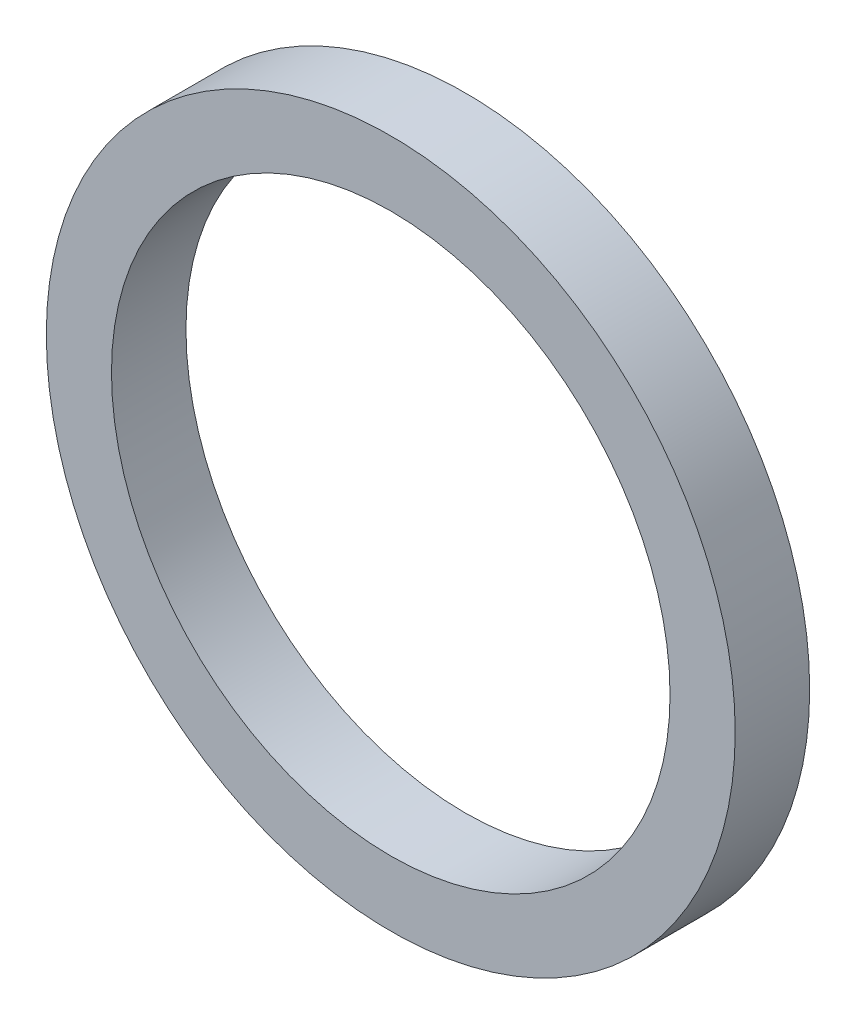
ISO-10303-21;
HEADER;
FILE_DESCRIPTION(('STEP AP214'),'2;1');
FILE_NAME('part.step','',(''),(''),'','','');
FILE_SCHEMA(('AUTOMOTIVE_DESIGN { 1 0 10303 214 1 1 1 1 }'));
ENDSEC;
DATA;
#1=APPLICATION_CONTEXT('core data for automotive mechanical design processes');
#2=APPLICATION_PROTOCOL_DEFINITION('international standard','automotive_design',2000,#1);
#3=PRODUCT_CONTEXT('',#1,'mechanical');
#4=PRODUCT('Part','Part','',(#3));
#5=PRODUCT_RELATED_PRODUCT_CATEGORY('part','',(#4));
#6=PRODUCT_DEFINITION_FORMATION('','',#4);
#7=PRODUCT_DEFINITION_CONTEXT('part definition',#1,'design');
#8=PRODUCT_DEFINITION('design','',#6,#7);
#9=PRODUCT_DEFINITION_SHAPE('','',#8);
#10=(LENGTH_UNIT() NAMED_UNIT(*) SI_UNIT(.MILLI.,.METRE.));
#11=(NAMED_UNIT(*) PLANE_ANGLE_UNIT() SI_UNIT($,.RADIAN.));
#12=(NAMED_UNIT(*) SI_UNIT($,.STERADIAN.) SOLID_ANGLE_UNIT());
#13=UNCERTAINTY_MEASURE_WITH_UNIT(LENGTH_MEASURE(1.E-05),#10,'distance_accuracy_value','');
#14=(GEOMETRIC_REPRESENTATION_CONTEXT(3) GLOBAL_UNCERTAINTY_ASSIGNED_CONTEXT((#13)) GLOBAL_UNIT_ASSIGNED_CONTEXT((#10,
#11,#12)) REPRESENTATION_CONTEXT('',''));
#15=CARTESIAN_POINT('',(0.,0.,0.));
#16=DIRECTION('',(0.,0.,1.));
#17=DIRECTION('',(1.,0.,0.));
#18=AXIS2_PLACEMENT_3D('',#15,#16,#17);
#19=CARTESIAN_POINT('',(0.,0.,4.));
#20=DIRECTION('',(0.,0.,1.));
#21=DIRECTION('',(1.,0.,0.));
#22=AXIS2_PLACEMENT_3D('',#19,#20,#21);
#23=PLANE('',#22);
#24=CARTESIAN_POINT('',(0.,0.,4.));
#25=DIRECTION('',(0.,0.,1.));
#26=DIRECTION('',(1.,0.,0.));
#27=AXIS2_PLACEMENT_3D('',#24,#25,#26);
#28=CIRCLE('',#27,18.5);
#29=CARTESIAN_POINT('',(18.5,0.,4.));
#30=VERTEX_POINT('',#29);
#31=EDGE_CURVE('E10',#30,#30,#28,.T.);
#32=ORIENTED_EDGE('',*,*,#31,.T.);
#33=EDGE_LOOP('',(#32));
#34=FACE_BOUND('',#33,.T.);
#35=CARTESIAN_POINT('',(0.,0.,4.));
#36=DIRECTION('',(0.,0.,1.));
#37=DIRECTION('',(1.,0.,0.));
#38=AXIS2_PLACEMENT_3D('',#35,#36,#37);
#39=CIRCLE('',#38,15.);
#40=CARTESIAN_POINT('',(15.,0.,4.));
#41=VERTEX_POINT('',#40);
#42=EDGE_CURVE('E48',#41,#41,#39,.T.);
#43=ORIENTED_EDGE('',*,*,#42,.F.);
#44=EDGE_LOOP('',(#43));
#45=FACE_BOUND('',#44,.T.);
#46=ADVANCED_FACE('F37',(#34,#45),#23,.T.);
#47=CARTESIAN_POINT('',(0.,0.,0.));
#48=DIRECTION('',(0.,0.,1.));
#49=DIRECTION('',(1.,0.,0.));
#50=AXIS2_PLACEMENT_3D('',#47,#48,#49);
#51=PLANE('',#50);
#52=CARTESIAN_POINT('',(0.,0.,0.));
#53=DIRECTION('',(0.,0.,1.));
#54=DIRECTION('',(1.,0.,0.));
#55=AXIS2_PLACEMENT_3D('',#52,#53,#54);
#56=CIRCLE('',#55,18.5);
#57=CARTESIAN_POINT('',(18.5,0.,0.));
#58=VERTEX_POINT('',#57);
#59=EDGE_CURVE('E41',#58,#58,#56,.T.);
#60=ORIENTED_EDGE('',*,*,#59,.F.);
#61=EDGE_LOOP('',(#60));
#62=FACE_BOUND('',#61,.T.);
#63=CARTESIAN_POINT('',(0.,0.,0.));
#64=DIRECTION('',(0.,0.,1.));
#65=DIRECTION('',(1.,0.,0.));
#66=AXIS2_PLACEMENT_3D('',#63,#64,#65);
#67=CIRCLE('',#66,15.);
#68=CARTESIAN_POINT('',(15.,0.,0.));
#69=VERTEX_POINT('',#68);
#70=EDGE_CURVE('E50',#69,#69,#67,.T.);
#71=ORIENTED_EDGE('',*,*,#70,.T.);
#72=EDGE_LOOP('',(#71));
#73=FACE_BOUND('',#72,.T.);
#74=ADVANCED_FACE('F60',(#62,#73),#51,.F.);
#75=CARTESIAN_POINT('',(0.,0.,4.));
#76=DIRECTION('',(0.,0.,-1.));
#77=DIRECTION('',(-1.,0.,0.));
#78=AXIS2_PLACEMENT_3D('',#75,#76,#77);
#79=CYLINDRICAL_SURFACE('',#78,18.5);
#80=ORIENTED_EDGE('',*,*,#31,.F.);
#81=EDGE_LOOP('',(#80));
#82=FACE_BOUND('',#81,.T.);
#83=ORIENTED_EDGE('',*,*,#59,.T.);
#84=EDGE_LOOP('',(#83));
#85=FACE_BOUND('',#84,.T.);
#86=ADVANCED_FACE('F39',(#82,#85),#79,.T.);
#87=CARTESIAN_POINT('',(0.,0.,4.));
#88=DIRECTION('',(0.,0.,-1.));
#89=DIRECTION('',(-1.,0.,0.));
#90=AXIS2_PLACEMENT_3D('',#87,#88,#89);
#91=CYLINDRICAL_SURFACE('',#90,15.);
#92=ORIENTED_EDGE('',*,*,#42,.T.);
#93=EDGE_LOOP('',(#92));
#94=FACE_BOUND('',#93,.T.);
#95=ORIENTED_EDGE('',*,*,#70,.F.);
#96=EDGE_LOOP('',(#95));
#97=FACE_BOUND('',#96,.T.);
#98=ADVANCED_FACE('F56',(#94,#97),#91,.F.);
#99=CLOSED_SHELL('',(#46,#74,#86,#98));
#100=MANIFOLD_SOLID_BREP('B2',#99);
#101=ADVANCED_BREP_SHAPE_REPRESENTATION('',(#18,#100),#14);
#102=SHAPE_DEFINITION_REPRESENTATION(#9,#101);
ENDSEC;
END-ISO-10303-21;
